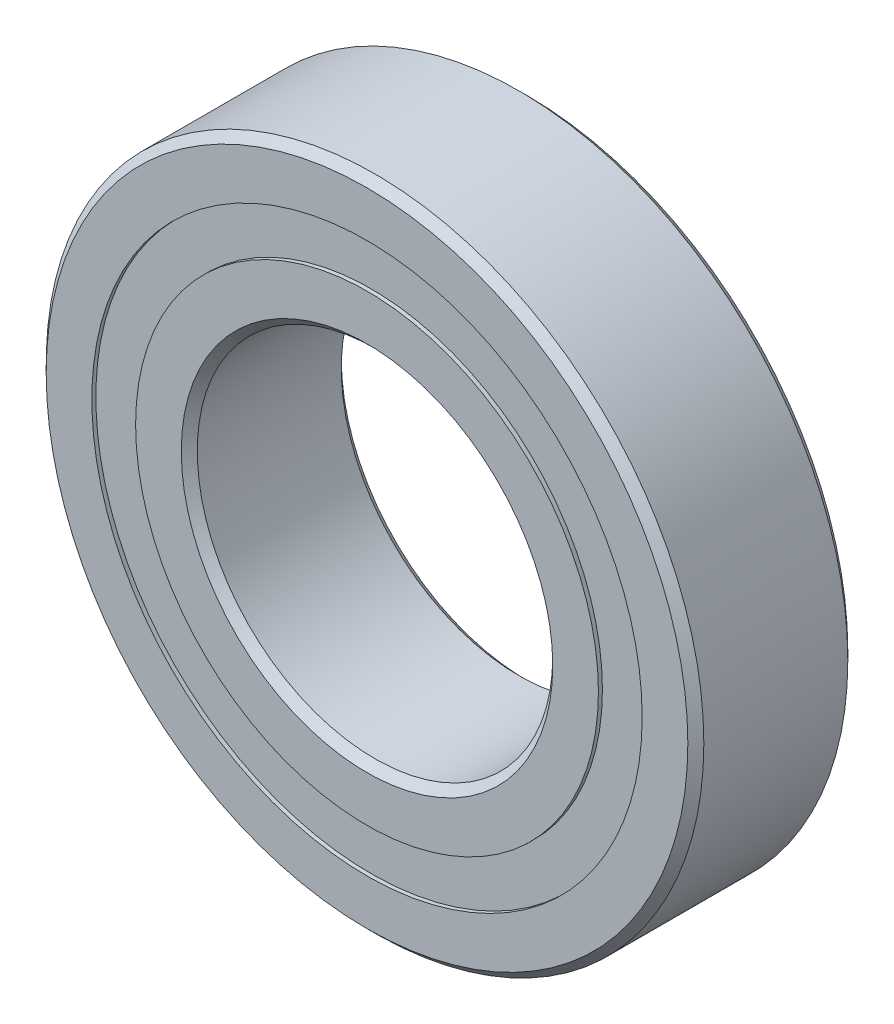
ISO-10303-21;
HEADER;
FILE_DESCRIPTION(('STEP AP214'),'2;1');
FILE_NAME('part.step','',(''),(''),'','','');
FILE_SCHEMA(('AUTOMOTIVE_DESIGN { 1 0 10303 214 1 1 1 1 }'));
ENDSEC;
DATA;
#1=APPLICATION_CONTEXT('core data for automotive mechanical design processes');
#2=APPLICATION_PROTOCOL_DEFINITION('international standard','automotive_design',2000,#1);
#3=PRODUCT_CONTEXT('',#1,'mechanical');
#4=PRODUCT('Part','Part','',(#3));
#5=PRODUCT_RELATED_PRODUCT_CATEGORY('part','',(#4));
#6=PRODUCT_DEFINITION_FORMATION('','',#4);
#7=PRODUCT_DEFINITION_CONTEXT('part definition',#1,'design');
#8=PRODUCT_DEFINITION('design','',#6,#7);
#9=PRODUCT_DEFINITION_SHAPE('','',#8);
#10=(LENGTH_UNIT() NAMED_UNIT(*) SI_UNIT(.MILLI.,.METRE.));
#11=(NAMED_UNIT(*) PLANE_ANGLE_UNIT() SI_UNIT($,.RADIAN.));
#12=(NAMED_UNIT(*) SI_UNIT($,.STERADIAN.) SOLID_ANGLE_UNIT());
#13=UNCERTAINTY_MEASURE_WITH_UNIT(LENGTH_MEASURE(1.E-05),#10,'distance_accuracy_value','');
#14=(GEOMETRIC_REPRESENTATION_CONTEXT(3) GLOBAL_UNCERTAINTY_ASSIGNED_CONTEXT((#13)) GLOBAL_UNIT_ASSIGNED_CONTEXT((#10,
#11,#12)) REPRESENTATION_CONTEXT('',''));
#15=CARTESIAN_POINT('',(0.,0.,0.));
#16=DIRECTION('',(0.,0.,1.));
#17=DIRECTION('',(1.,0.,0.));
#18=AXIS2_PLACEMENT_3D('',#15,#16,#17);
#19=CARTESIAN_POINT('',(0.,15.4807692307692,-4.27499999999997));
#20=DIRECTION('',(0.,0.,1.));
#21=DIRECTION('',(1.,0.,0.));
#22=AXIS2_PLACEMENT_3D('',#19,#20,#21);
#23=PLANE('',#22);
#24=CARTESIAN_POINT('',(0.,0.,-4.27500000000003));
#25=DIRECTION('',(0.,0.,1.));
#26=DIRECTION('',(1.,0.,0.));
#27=AXIS2_PLACEMENT_3D('',#24,#25,#26);
#28=CIRCLE('',#27,15.4807692307692);
#29=CARTESIAN_POINT('',(15.4807692307692,0.,-4.27500000000003));
#30=VERTEX_POINT('',#29);
#31=EDGE_CURVE('E66',#30,#30,#28,.T.);
#32=ORIENTED_EDGE('',*,*,#31,.F.);
#33=EDGE_LOOP('',(#32));
#34=FACE_BOUND('',#33,.T.);
#35=CARTESIAN_POINT('',(0.,0.,-4.27500000000003));
#36=DIRECTION('',(0.,0.,1.));
#37=DIRECTION('',(1.,0.,0.));
#38=AXIS2_PLACEMENT_3D('',#35,#36,#37);
#39=CIRCLE('',#38,13.0192307692308);
#40=CARTESIAN_POINT('',(13.0192307692308,0.,-4.27500000000003));
#41=VERTEX_POINT('',#40);
#42=EDGE_CURVE('E11',#41,#41,#39,.T.);
#43=ORIENTED_EDGE('',*,*,#42,.T.);
#44=EDGE_LOOP('',(#43));
#45=FACE_BOUND('',#44,.T.);
#46=ADVANCED_FACE('F52',(#34,#45),#23,.F.);
#47=CARTESIAN_POINT('',(0.,0.,4.5));
#48=DIRECTION('',(0.,0.,1.));
#49=DIRECTION('',(1.,0.,0.));
#50=AXIS2_PLACEMENT_3D('',#47,#48,#49);
#51=CYLINDRICAL_SURFACE('',#50,13.0192307692308);
#52=ORIENTED_EDGE('',*,*,#42,.F.);
#53=EDGE_LOOP('',(#52));
#54=FACE_BOUND('',#53,.T.);
#55=CARTESIAN_POINT('',(0.,0.,-2.34835961884211));
#56=DIRECTION('',(0.,0.,1.));
#57=DIRECTION('',(1.,0.,0.));
#58=AXIS2_PLACEMENT_3D('',#55,#56,#57);
#59=CIRCLE('',#58,13.0192307692308);
#60=CARTESIAN_POINT('',(13.0192307692308,0.,-2.34835961884211));
#61=VERTEX_POINT('',#60);
#62=EDGE_CURVE('E58',#61,#61,#59,.T.);
#63=ORIENTED_EDGE('',*,*,#62,.T.);
#64=EDGE_LOOP('',(#63));
#65=FACE_BOUND('',#64,.T.);
#66=ADVANCED_FACE('F75',(#54,#65),#51,.F.);
#67=CARTESIAN_POINT('',(0.,15.4807692307692,-2.34835961884211));
#68=DIRECTION('',(0.,0.,-1.));
#69=DIRECTION('',(-1.,0.,0.));
#70=AXIS2_PLACEMENT_3D('',#67,#68,#69);
#71=PLANE('',#70);
#72=ORIENTED_EDGE('',*,*,#62,.F.);
#73=EDGE_LOOP('',(#72));
#74=FACE_BOUND('',#73,.T.);
#75=CARTESIAN_POINT('',(0.,0.,-2.34835961884211));
#76=DIRECTION('',(0.,0.,1.));
#77=DIRECTION('',(1.,0.,0.));
#78=AXIS2_PLACEMENT_3D('',#75,#76,#77);
#79=CIRCLE('',#78,15.4807692307692);
#80=CARTESIAN_POINT('',(15.4807692307692,0.,-2.34835961884211));
#81=VERTEX_POINT('',#80);
#82=EDGE_CURVE('E62',#81,#81,#79,.T.);
#83=ORIENTED_EDGE('',*,*,#82,.T.);
#84=EDGE_LOOP('',(#83));
#85=FACE_BOUND('',#84,.T.);
#86=ADVANCED_FACE('F79',(#74,#85),#71,.F.);
#87=CARTESIAN_POINT('',(0.,0.,4.5));
#88=DIRECTION('',(0.,0.,1.));
#89=DIRECTION('',(1.,0.,0.));
#90=AXIS2_PLACEMENT_3D('',#87,#88,#89);
#91=CYLINDRICAL_SURFACE('',#90,15.4807692307692);
#92=ORIENTED_EDGE('',*,*,#82,.F.);
#93=EDGE_LOOP('',(#92));
#94=FACE_BOUND('',#93,.T.);
#95=ORIENTED_EDGE('',*,*,#31,.T.);
#96=EDGE_LOOP('',(#95));
#97=FACE_BOUND('',#96,.T.);
#98=ADVANCED_FACE('F72',(#94,#97),#91,.T.);
#99=CLOSED_SHELL('',(#46,#66,#86,#98));
#100=MANIFOLD_SOLID_BREP('B2',#99);
#101=CARTESIAN_POINT('',(0.,15.4807692307692,4.27500000000003));
#102=DIRECTION('',(0.,0.,-1.));
#103=DIRECTION('',(-1.,0.,0.));
#104=AXIS2_PLACEMENT_3D('',#101,#102,#103);
#105=PLANE('',#104);
#106=CARTESIAN_POINT('',(0.,0.,4.27500000000003));
#107=DIRECTION('',(0.,0.,1.));
#108=DIRECTION('',(1.,0.,0.));
#109=AXIS2_PLACEMENT_3D('',#106,#107,#108);
#110=CIRCLE('',#109,13.0192307692308);
#111=CARTESIAN_POINT('',(13.0192307692308,0.,4.27500000000003));
#112=VERTEX_POINT('',#111);
#113=EDGE_CURVE('E51',#112,#112,#110,.T.);
#114=ORIENTED_EDGE('',*,*,#113,.F.);
#115=EDGE_LOOP('',(#114));
#116=FACE_BOUND('',#115,.T.);
#117=CARTESIAN_POINT('',(0.,0.,4.27500000000003));
#118=DIRECTION('',(0.,0.,1.));
#119=DIRECTION('',(1.,0.,0.));
#120=AXIS2_PLACEMENT_3D('',#117,#118,#119);
#121=CIRCLE('',#120,15.4807692307692);
#122=CARTESIAN_POINT('',(15.4807692307692,0.,4.27500000000003));
#123=VERTEX_POINT('',#122);
#124=EDGE_CURVE('E142',#123,#123,#121,.T.);
#125=ORIENTED_EDGE('',*,*,#124,.T.);
#126=EDGE_LOOP('',(#125));
#127=FACE_BOUND('',#126,.T.);
#128=ADVANCED_FACE('F128',(#116,#127),#105,.F.);
#129=CARTESIAN_POINT('',(0.,0.,4.5));
#130=DIRECTION('',(0.,0.,1.));
#131=DIRECTION('',(1.,0.,0.));
#132=AXIS2_PLACEMENT_3D('',#129,#130,#131);
#133=CYLINDRICAL_SURFACE('',#132,13.0192307692308);
#134=CARTESIAN_POINT('',(0.,0.,2.34835961884211));
#135=DIRECTION('',(0.,0.,1.));
#136=DIRECTION('',(1.,0.,0.));
#137=AXIS2_PLACEMENT_3D('',#134,#135,#136);
#138=CIRCLE('',#137,13.0192307692308);
#139=CARTESIAN_POINT('',(13.0192307692308,0.,2.34835961884211));
#140=VERTEX_POINT('',#139);
#141=EDGE_CURVE('E134',#140,#140,#138,.T.);
#142=ORIENTED_EDGE('',*,*,#141,.F.);
#143=EDGE_LOOP('',(#142));
#144=FACE_BOUND('',#143,.T.);
#145=ORIENTED_EDGE('',*,*,#113,.T.);
#146=EDGE_LOOP('',(#145));
#147=FACE_BOUND('',#146,.T.);
#148=ADVANCED_FACE('F157',(#144,#147),#133,.F.);
#149=CARTESIAN_POINT('',(0.,15.4807692307692,2.34835961884211));
#150=DIRECTION('',(0.,0.,1.));
#151=DIRECTION('',(1.,0.,0.));
#152=AXIS2_PLACEMENT_3D('',#149,#150,#151);
#153=PLANE('',#152);
#154=CARTESIAN_POINT('',(0.,0.,2.34835961884211));
#155=DIRECTION('',(0.,0.,1.));
#156=DIRECTION('',(1.,0.,0.));
#157=AXIS2_PLACEMENT_3D('',#154,#155,#156);
#158=CIRCLE('',#157,15.4807692307692);
#159=CARTESIAN_POINT('',(15.4807692307692,0.,2.34835961884211));
#160=VERTEX_POINT('',#159);
#161=EDGE_CURVE('E138',#160,#160,#158,.T.);
#162=ORIENTED_EDGE('',*,*,#161,.F.);
#163=EDGE_LOOP('',(#162));
#164=FACE_BOUND('',#163,.T.);
#165=ORIENTED_EDGE('',*,*,#141,.T.);
#166=EDGE_LOOP('',(#165));
#167=FACE_BOUND('',#166,.T.);
#168=ADVANCED_FACE('F152',(#164,#167),#153,.F.);
#169=CARTESIAN_POINT('',(0.,0.,4.5));
#170=DIRECTION('',(0.,0.,1.));
#171=DIRECTION('',(1.,0.,0.));
#172=AXIS2_PLACEMENT_3D('',#169,#170,#171);
#173=CYLINDRICAL_SURFACE('',#172,15.4807692307692);
#174=ORIENTED_EDGE('',*,*,#124,.F.);
#175=EDGE_LOOP('',(#174));
#176=FACE_BOUND('',#175,.T.);
#177=ORIENTED_EDGE('',*,*,#161,.T.);
#178=EDGE_LOOP('',(#177));
#179=FACE_BOUND('',#178,.T.);
#180=ADVANCED_FACE('F149',(#176,#179),#173,.T.);
#181=CLOSED_SHELL('',(#128,#148,#168,#180));
#182=MANIFOLD_SOLID_BREP('B6',#181);
#183=CARTESIAN_POINT('',(-7.12499999999984,12.3408620039283,0.));
#184=DIRECTION('',(0.,0.,1.));
#185=DIRECTION('',(-0.499999999999989,0.866025403784445,0.));
#186=AXIS2_PLACEMENT_3D('',#183,#184,#185);
#187=SPHERICAL_SURFACE('',#186,2.34835961884211);
#188=CARTESIAN_POINT('',(-7.12499999999984,12.3408620039283,2.34835961884211));
#189=VERTEX_POINT('',#188);
#190=VERTEX_LOOP('',#189);
#191=FACE_BOUND('',#190,.T.);
#192=ADVANCED_FACE('F204',(#191),#187,.T.);
#193=CLOSED_SHELL('',(#192));
#194=MANIFOLD_SOLID_BREP('B46',#193);
#195=CARTESIAN_POINT('',(-12.3408620039282,7.12500000000014,0.));
#196=DIRECTION('',(0.,0.,1.));
#197=DIRECTION('',(-0.866025403784433,0.50000000000001,0.));
#198=AXIS2_PLACEMENT_3D('',#195,#196,#197);
#199=SPHERICAL_SURFACE('',#198,2.34835961884211);
#200=CARTESIAN_POINT('',(-12.3408620039282,7.12500000000014,2.34835961884211));
#201=VERTEX_POINT('',#200);
#202=VERTEX_LOOP('',#201);
#203=FACE_BOUND('',#202,.T.);
#204=ADVANCED_FACE('F227',(#203),#199,.T.);
#205=CLOSED_SHELL('',(#204));
#206=MANIFOLD_SOLID_BREP('B124',#205);
#207=CARTESIAN_POINT('',(-14.25,1.49260827235544E-13,0.));
#208=DIRECTION('',(0.,0.,1.));
#209=DIRECTION('',(-1.,0.,0.));
#210=AXIS2_PLACEMENT_3D('',#207,#208,#209);
#211=SPHERICAL_SURFACE('',#210,2.34835961884211);
#212=CARTESIAN_POINT('',(-14.25,1.49260827235544E-13,2.34835961884211));
#213=VERTEX_POINT('',#212);
#214=VERTEX_LOOP('',#213);
#215=FACE_BOUND('',#214,.T.);
#216=ADVANCED_FACE('F250',(#215),#211,.T.);
#217=CLOSED_SHELL('',(#216));
#218=MANIFOLD_SOLID_BREP('B200',#217);
#219=CARTESIAN_POINT('',(-12.3408620039283,-7.12499999999988,0.));
#220=DIRECTION('',(0.,0.,1.));
#221=DIRECTION('',(-0.866025403784443,-0.499999999999992,0.));
#222=AXIS2_PLACEMENT_3D('',#219,#220,#221);
#223=SPHERICAL_SURFACE('',#222,2.34835961884211);
#224=CARTESIAN_POINT('',(-12.3408620039283,-7.12499999999988,2.34835961884211));
#225=VERTEX_POINT('',#224);
#226=VERTEX_LOOP('',#225);
#227=FACE_BOUND('',#226,.T.);
#228=ADVANCED_FACE('F273',(#227),#223,.T.);
#229=CLOSED_SHELL('',(#228));
#230=MANIFOLD_SOLID_BREP('B223',#229);
#231=CARTESIAN_POINT('',(-7.1250000000001,-12.3408620039282,0.));
#232=DIRECTION('',(0.,0.,1.));
#233=DIRECTION('',(-0.500000000000007,-0.866025403784435,0.));
#234=AXIS2_PLACEMENT_3D('',#231,#232,#233);
#235=SPHERICAL_SURFACE('',#234,2.34835961884211);
#236=CARTESIAN_POINT('',(-7.1250000000001,-12.3408620039282,2.34835961884211));
#237=VERTEX_POINT('',#236);
#238=VERTEX_LOOP('',#237);
#239=FACE_BOUND('',#238,.T.);
#240=ADVANCED_FACE('F296',(#239),#235,.T.);
#241=CLOSED_SHELL('',(#240));
#242=MANIFOLD_SOLID_BREP('B246',#241);
#243=CARTESIAN_POINT('',(0.,-14.25,0.));
#244=DIRECTION('',(0.,0.,1.));
#245=DIRECTION('',(0.,-1.,0.));
#246=AXIS2_PLACEMENT_3D('',#243,#244,#245);
#247=SPHERICAL_SURFACE('',#246,2.34835961884211);
#248=CARTESIAN_POINT('',(0.,-14.25,2.34835961884211));
#249=VERTEX_POINT('',#248);
#250=VERTEX_LOOP('',#249);
#251=FACE_BOUND('',#250,.T.);
#252=ADVANCED_FACE('F319',(#251),#247,.T.);
#253=CLOSED_SHELL('',(#252));
#254=MANIFOLD_SOLID_BREP('B269',#253);
#255=CARTESIAN_POINT('',(7.12499999999993,-12.3408620039283,0.));
#256=DIRECTION('',(0.,0.,1.));
#257=DIRECTION('',(0.499999999999995,-0.866025403784442,0.));
#258=AXIS2_PLACEMENT_3D('',#255,#256,#257);
#259=SPHERICAL_SURFACE('',#258,2.34835961884211);
#260=CARTESIAN_POINT('',(7.12499999999993,-12.3408620039283,2.34835961884211));
#261=VERTEX_POINT('',#260);
#262=VERTEX_LOOP('',#261);
#263=FACE_BOUND('',#262,.T.);
#264=ADVANCED_FACE('F342',(#263),#259,.T.);
#265=CLOSED_SHELL('',(#264));
#266=MANIFOLD_SOLID_BREP('B292',#265);
#267=CARTESIAN_POINT('',(12.3408620039282,-7.12500000000006,0.));
#268=DIRECTION('',(0.,0.,1.));
#269=DIRECTION('',(0.866025403784436,-0.500000000000004,0.));
#270=AXIS2_PLACEMENT_3D('',#267,#268,#269);
#271=SPHERICAL_SURFACE('',#270,2.34835961884211);
#272=CARTESIAN_POINT('',(12.3408620039282,-7.12500000000006,2.34835961884211));
#273=VERTEX_POINT('',#272);
#274=VERTEX_LOOP('',#273);
#275=FACE_BOUND('',#274,.T.);
#276=ADVANCED_FACE('F365',(#275),#271,.T.);
#277=CLOSED_SHELL('',(#276));
#278=MANIFOLD_SOLID_BREP('B315',#277);
#279=CARTESIAN_POINT('',(14.25,0.,0.));
#280=DIRECTION('',(0.,0.,1.));
#281=DIRECTION('',(1.,0.,0.));
#282=AXIS2_PLACEMENT_3D('',#279,#280,#281);
#283=SPHERICAL_SURFACE('',#282,2.34835961884211);
#284=CARTESIAN_POINT('',(14.25,0.,2.34835961884211));
#285=VERTEX_POINT('',#284);
#286=VERTEX_LOOP('',#285);
#287=FACE_BOUND('',#286,.T.);
#288=ADVANCED_FACE('F388',(#287),#283,.T.);
#289=CLOSED_SHELL('',(#288));
#290=MANIFOLD_SOLID_BREP('B338',#289);
#291=CARTESIAN_POINT('',(12.3408620039283,7.12499999999997,0.));
#292=DIRECTION('',(0.,0.,1.));
#293=DIRECTION('',(0.86602540378444,0.499999999999998,0.));
#294=AXIS2_PLACEMENT_3D('',#291,#292,#293);
#295=SPHERICAL_SURFACE('',#294,2.34835961884211);
#296=CARTESIAN_POINT('',(12.3408620039283,7.12499999999997,2.34835961884211));
#297=VERTEX_POINT('',#296);
#298=VERTEX_LOOP('',#297);
#299=FACE_BOUND('',#298,.T.);
#300=ADVANCED_FACE('F411',(#299),#295,.T.);
#301=CLOSED_SHELL('',(#300));
#302=MANIFOLD_SOLID_BREP('B361',#301);
#303=CARTESIAN_POINT('',(7.12500000000001,12.3408620039282,0.));
#304=DIRECTION('',(0.,0.,1.));
#305=DIRECTION('',(0.500000000000001,0.866025403784438,0.));
#306=AXIS2_PLACEMENT_3D('',#303,#304,#305);
#307=SPHERICAL_SURFACE('',#306,2.34835961884211);
#308=CARTESIAN_POINT('',(7.12500000000001,12.3408620039282,2.34835961884211));
#309=VERTEX_POINT('',#308);
#310=VERTEX_LOOP('',#309);
#311=FACE_BOUND('',#310,.T.);
#312=ADVANCED_FACE('F434',(#311),#307,.T.);
#313=CLOSED_SHELL('',(#312));
#314=MANIFOLD_SOLID_BREP('B384',#313);
#315=CARTESIAN_POINT('',(0.,14.25,0.));
#316=DIRECTION('',(0.,0.,1.));
#317=DIRECTION('',(0.,1.,0.));
#318=AXIS2_PLACEMENT_3D('',#315,#316,#317);
#319=SPHERICAL_SURFACE('',#318,2.34835961884211);
#320=CARTESIAN_POINT('',(0.,14.25,2.34835961884211));
#321=VERTEX_POINT('',#320);
#322=VERTEX_LOOP('',#321);
#323=FACE_BOUND('',#322,.T.);
#324=ADVANCED_FACE('F459',(#323),#319,.T.);
#325=CLOSED_SHELL('',(#324));
#326=MANIFOLD_SOLID_BREP('B407',#325);
#327=CARTESIAN_POINT('',(0.,13.0192307692308,4.5));
#328=DIRECTION('',(0.,0.,-1.));
#329=DIRECTION('',(-1.,0.,0.));
#330=AXIS2_PLACEMENT_3D('',#327,#328,#329);
#331=PLANE('',#330);
#332=CARTESIAN_POINT('',(0.,0.,4.5));
#333=DIRECTION('',(0.,0.,1.));
#334=DIRECTION('',(1.,0.,0.));
#335=AXIS2_PLACEMENT_3D('',#332,#333,#334);
#336=CIRCLE('',#335,10.45);
#337=CARTESIAN_POINT('',(10.45,0.,4.5));
#338=VERTEX_POINT('',#337);
#339=EDGE_CURVE('E505',#338,#338,#336,.T.);
#340=ORIENTED_EDGE('',*,*,#339,.F.);
#341=EDGE_LOOP('',(#340));
#342=FACE_BOUND('',#341,.T.);
#343=CARTESIAN_POINT('',(0.,0.,4.5));
#344=DIRECTION('',(0.,0.,1.));
#345=DIRECTION('',(1.,0.,0.));
#346=AXIS2_PLACEMENT_3D('',#343,#344,#345);
#347=CIRCLE('',#346,13.0192307692308);
#348=CARTESIAN_POINT('',(13.0192307692308,0.,4.5));
#349=VERTEX_POINT('',#348);
#350=EDGE_CURVE('E458',#349,#349,#347,.T.);
#351=ORIENTED_EDGE('',*,*,#350,.T.);
#352=EDGE_LOOP('',(#351));
#353=FACE_BOUND('',#352,.T.);
#354=ADVANCED_FACE('F477',(#342,#353),#331,.F.);
#355=CARTESIAN_POINT('',(0.,0.,4.5));
#356=DIRECTION('',(0.,0.,1.));
#357=DIRECTION('',(1.,0.,0.));
#358=AXIS2_PLACEMENT_3D('',#355,#356,#357);
#359=CYLINDRICAL_SURFACE('',#358,13.0192307692308);
#360=ORIENTED_EDGE('',*,*,#350,.F.);
#361=EDGE_LOOP('',(#360));
#362=FACE_BOUND('',#361,.T.);
#363=CARTESIAN_POINT('',(0.,0.,2.));
#364=DIRECTION('',(0.,0.,1.));
#365=DIRECTION('',(1.,0.,0.));
#366=AXIS2_PLACEMENT_3D('',#363,#364,#365);
#367=CIRCLE('',#366,13.0192307692308);
#368=CARTESIAN_POINT('',(13.0192307692308,0.,2.));
#369=VERTEX_POINT('',#368);
#370=EDGE_CURVE('E483',#369,#369,#367,.T.);
#371=ORIENTED_EDGE('',*,*,#370,.T.);
#372=EDGE_LOOP('',(#371));
#373=FACE_BOUND('',#372,.T.);
#374=ADVANCED_FACE('F512',(#362,#373),#359,.T.);
#375=CARTESIAN_POINT('',(0.,0.,0.));
#376=DIRECTION('',(0.,0.,1.));
#377=DIRECTION('',(1.,0.,0.));
#378=AXIS2_PLACEMENT_3D('',#375,#376,#377);
#379=TOROIDAL_SURFACE('',#378,14.25,2.34835961884211);
#380=ORIENTED_EDGE('',*,*,#370,.F.);
#381=EDGE_LOOP('',(#380));
#382=FACE_BOUND('',#381,.T.);
#383=CARTESIAN_POINT('',(0.,0.,-2.));
#384=DIRECTION('',(0.,0.,1.));
#385=DIRECTION('',(1.,0.,0.));
#386=AXIS2_PLACEMENT_3D('',#383,#384,#385);
#387=CIRCLE('',#386,13.0192307692308);
#388=CARTESIAN_POINT('',(13.0192307692308,0.,-2.));
#389=VERTEX_POINT('',#388);
#390=EDGE_CURVE('E487',#389,#389,#387,.T.);
#391=ORIENTED_EDGE('',*,*,#390,.T.);
#392=EDGE_LOOP('',(#391));
#393=FACE_BOUND('',#392,.T.);
#394=ADVANCED_FACE('F516',(#382,#393),#379,.F.);
#395=CARTESIAN_POINT('',(0.,0.,4.5));
#396=DIRECTION('',(0.,0.,1.));
#397=DIRECTION('',(1.,0.,0.));
#398=AXIS2_PLACEMENT_3D('',#395,#396,#397);
#399=CYLINDRICAL_SURFACE('',#398,13.0192307692308);
#400=ORIENTED_EDGE('',*,*,#390,.F.);
#401=EDGE_LOOP('',(#400));
#402=FACE_BOUND('',#401,.T.);
#403=CARTESIAN_POINT('',(0.,0.,-4.5));
#404=DIRECTION('',(0.,0.,1.));
#405=DIRECTION('',(1.,0.,0.));
#406=AXIS2_PLACEMENT_3D('',#403,#404,#405);
#407=CIRCLE('',#406,13.0192307692308);
#408=CARTESIAN_POINT('',(13.0192307692308,0.,-4.5));
#409=VERTEX_POINT('',#408);
#410=EDGE_CURVE('E491',#409,#409,#407,.T.);
#411=ORIENTED_EDGE('',*,*,#410,.T.);
#412=EDGE_LOOP('',(#411));
#413=FACE_BOUND('',#412,.T.);
#414=ADVANCED_FACE('F521',(#402,#413),#399,.T.);
#415=CARTESIAN_POINT('',(0.,10.45,-4.5));
#416=DIRECTION('',(0.,0.,1.));
#417=DIRECTION('',(1.,0.,0.));
#418=AXIS2_PLACEMENT_3D('',#415,#416,#417);
#419=PLANE('',#418);
#420=ORIENTED_EDGE('',*,*,#410,.F.);
#421=EDGE_LOOP('',(#420));
#422=FACE_BOUND('',#421,.T.);
#423=CARTESIAN_POINT('',(0.,0.,-4.5));
#424=DIRECTION('',(0.,0.,1.));
#425=DIRECTION('',(1.,0.,0.));
#426=AXIS2_PLACEMENT_3D('',#423,#424,#425);
#427=CIRCLE('',#426,10.45);
#428=CARTESIAN_POINT('',(10.45,0.,-4.5));
#429=VERTEX_POINT('',#428);
#430=EDGE_CURVE('E496',#429,#429,#427,.T.);
#431=ORIENTED_EDGE('',*,*,#430,.T.);
#432=EDGE_LOOP('',(#431));
#433=FACE_BOUND('',#432,.T.);
#434=ADVANCED_FACE('F527',(#422,#433),#419,.F.);
#435=CARTESIAN_POINT('',(0.,0.,-4.05));
#436=DIRECTION('',(0.,0.,-1.));
#437=DIRECTION('',(-1.,0.,0.));
#438=AXIS2_PLACEMENT_3D('',#435,#436,#437);
#439=CONICAL_SURFACE('',#438,10.,0.785398163397448);
#440=ORIENTED_EDGE('',*,*,#430,.F.);
#441=EDGE_LOOP('',(#440));
#442=FACE_BOUND('',#441,.T.);
#443=CARTESIAN_POINT('',(0.,0.,-4.05));
#444=DIRECTION('',(0.,0.,1.));
#445=DIRECTION('',(1.,0.,0.));
#446=AXIS2_PLACEMENT_3D('',#443,#444,#445);
#447=CIRCLE('',#446,10.);
#448=CARTESIAN_POINT('',(10.,0.,-4.05));
#449=VERTEX_POINT('',#448);
#450=EDGE_CURVE('E499',#449,#449,#447,.T.);
#451=ORIENTED_EDGE('',*,*,#450,.T.);
#452=EDGE_LOOP('',(#451));
#453=FACE_BOUND('',#452,.T.);
#454=ADVANCED_FACE('F531',(#442,#453),#439,.F.);
#455=CARTESIAN_POINT('',(0.,0.,4.5));
#456=DIRECTION('',(0.,0.,1.));
#457=DIRECTION('',(1.,0.,0.));
#458=AXIS2_PLACEMENT_3D('',#455,#456,#457);
#459=CYLINDRICAL_SURFACE('',#458,10.);
#460=ORIENTED_EDGE('',*,*,#450,.F.);
#461=EDGE_LOOP('',(#460));
#462=FACE_BOUND('',#461,.T.);
#463=CARTESIAN_POINT('',(0.,0.,4.05));
#464=DIRECTION('',(0.,0.,1.));
#465=DIRECTION('',(1.,0.,0.));
#466=AXIS2_PLACEMENT_3D('',#463,#464,#465);
#467=CIRCLE('',#466,10.);
#468=CARTESIAN_POINT('',(10.,0.,4.05));
#469=VERTEX_POINT('',#468);
#470=EDGE_CURVE('E502',#469,#469,#467,.T.);
#471=ORIENTED_EDGE('',*,*,#470,.T.);
#472=EDGE_LOOP('',(#471));
#473=FACE_BOUND('',#472,.T.);
#474=ADVANCED_FACE('F535',(#462,#473),#459,.F.);
#475=CARTESIAN_POINT('',(0.,0.,4.5));
#476=DIRECTION('',(0.,0.,1.));
#477=DIRECTION('',(1.,0.,0.));
#478=AXIS2_PLACEMENT_3D('',#475,#476,#477);
#479=CONICAL_SURFACE('',#478,10.45,0.785398163397448);
#480=ORIENTED_EDGE('',*,*,#470,.F.);
#481=EDGE_LOOP('',(#480));
#482=FACE_BOUND('',#481,.T.);
#483=ORIENTED_EDGE('',*,*,#339,.T.);
#484=EDGE_LOOP('',(#483));
#485=FACE_BOUND('',#484,.T.);
#486=ADVANCED_FACE('F509',(#482,#485),#479,.F.);
#487=CLOSED_SHELL('',(#354,#374,#394,#414,#434,#454,#474,#486));
#488=MANIFOLD_SOLID_BREP('B430',#487);
#489=CARTESIAN_POINT('',(0.,0.,4.05));
#490=DIRECTION('',(0.,0.,-1.));
#491=DIRECTION('',(-1.,0.,0.));
#492=AXIS2_PLACEMENT_3D('',#489,#490,#491);
#493=CONICAL_SURFACE('',#492,18.5,0.785398163397447);
#494=CARTESIAN_POINT('',(0.,0.,4.5));
#495=DIRECTION('',(0.,0.,1.));
#496=DIRECTION('',(1.,0.,0.));
#497=AXIS2_PLACEMENT_3D('',#494,#495,#496);
#498=CIRCLE('',#497,18.05);
#499=CARTESIAN_POINT('',(18.05,0.,4.5));
#500=VERTEX_POINT('',#499);
#501=EDGE_CURVE('E611',#500,#500,#498,.T.);
#502=ORIENTED_EDGE('',*,*,#501,.F.);
#503=EDGE_LOOP('',(#502));
#504=FACE_BOUND('',#503,.T.);
#505=CARTESIAN_POINT('',(0.,0.,4.05));
#506=DIRECTION('',(0.,0.,1.));
#507=DIRECTION('',(1.,0.,0.));
#508=AXIS2_PLACEMENT_3D('',#505,#506,#507);
#509=CIRCLE('',#508,18.5);
#510=CARTESIAN_POINT('',(18.5,0.,4.05));
#511=VERTEX_POINT('',#510);
#512=EDGE_CURVE('E476',#511,#511,#509,.T.);
#513=ORIENTED_EDGE('',*,*,#512,.T.);
#514=EDGE_LOOP('',(#513));
#515=FACE_BOUND('',#514,.T.);
#516=ADVANCED_FACE('F583',(#504,#515),#493,.T.);
#517=CARTESIAN_POINT('',(0.,0.,4.5));
#518=DIRECTION('',(0.,0.,1.));
#519=DIRECTION('',(1.,0.,0.));
#520=AXIS2_PLACEMENT_3D('',#517,#518,#519);
#521=CYLINDRICAL_SURFACE('',#520,18.5);
#522=ORIENTED_EDGE('',*,*,#512,.F.);
#523=EDGE_LOOP('',(#522));
#524=FACE_BOUND('',#523,.T.);
#525=CARTESIAN_POINT('',(0.,0.,-4.05));
#526=DIRECTION('',(0.,0.,1.));
#527=DIRECTION('',(1.,0.,0.));
#528=AXIS2_PLACEMENT_3D('',#525,#526,#527);
#529=CIRCLE('',#528,18.5);
#530=CARTESIAN_POINT('',(18.5,0.,-4.05));
#531=VERTEX_POINT('',#530);
#532=EDGE_CURVE('E589',#531,#531,#529,.T.);
#533=ORIENTED_EDGE('',*,*,#532,.T.);
#534=EDGE_LOOP('',(#533));
#535=FACE_BOUND('',#534,.T.);
#536=ADVANCED_FACE('F618',(#524,#535),#521,.T.);
#537=CARTESIAN_POINT('',(0.,0.,-4.5));
#538=DIRECTION('',(0.,0.,1.));
#539=DIRECTION('',(1.,0.,0.));
#540=AXIS2_PLACEMENT_3D('',#537,#538,#539);
#541=CONICAL_SURFACE('',#540,18.05,0.785398163397448);
#542=ORIENTED_EDGE('',*,*,#532,.F.);
#543=EDGE_LOOP('',(#542));
#544=FACE_BOUND('',#543,.T.);
#545=CARTESIAN_POINT('',(0.,0.,-4.5));
#546=DIRECTION('',(0.,0.,1.));
#547=DIRECTION('',(1.,0.,0.));
#548=AXIS2_PLACEMENT_3D('',#545,#546,#547);
#549=CIRCLE('',#548,18.05);
#550=CARTESIAN_POINT('',(18.05,0.,-4.5));
#551=VERTEX_POINT('',#550);
#552=EDGE_CURVE('E593',#551,#551,#549,.T.);
#553=ORIENTED_EDGE('',*,*,#552,.T.);
#554=EDGE_LOOP('',(#553));
#555=FACE_BOUND('',#554,.T.);
#556=ADVANCED_FACE('F622',(#544,#555),#541,.T.);
#557=CARTESIAN_POINT('',(0.,18.05,-4.5));
#558=DIRECTION('',(0.,0.,1.));
#559=DIRECTION('',(1.,0.,0.));
#560=AXIS2_PLACEMENT_3D('',#557,#558,#559);
#561=PLANE('',#560);
#562=ORIENTED_EDGE('',*,*,#552,.F.);
#563=EDGE_LOOP('',(#562));
#564=FACE_BOUND('',#563,.T.);
#565=CARTESIAN_POINT('',(0.,0.,-4.5));
#566=DIRECTION('',(0.,0.,1.));
#567=DIRECTION('',(1.,0.,0.));
#568=AXIS2_PLACEMENT_3D('',#565,#566,#567);
#569=CIRCLE('',#568,15.4807692307692);
#570=CARTESIAN_POINT('',(15.4807692307692,0.,-4.5));
#571=VERTEX_POINT('',#570);
#572=EDGE_CURVE('E597',#571,#571,#569,.T.);
#573=ORIENTED_EDGE('',*,*,#572,.T.);
#574=EDGE_LOOP('',(#573));
#575=FACE_BOUND('',#574,.T.);
#576=ADVANCED_FACE('F627',(#564,#575),#561,.F.);
#577=CARTESIAN_POINT('',(0.,0.,4.5));
#578=DIRECTION('',(0.,0.,1.));
#579=DIRECTION('',(1.,0.,0.));
#580=AXIS2_PLACEMENT_3D('',#577,#578,#579);
#581=CYLINDRICAL_SURFACE('',#580,15.4807692307692);
#582=ORIENTED_EDGE('',*,*,#572,.F.);
#583=EDGE_LOOP('',(#582));
#584=FACE_BOUND('',#583,.T.);
#585=CARTESIAN_POINT('',(0.,0.,-2.));
#586=DIRECTION('',(0.,0.,1.));
#587=DIRECTION('',(1.,0.,0.));
#588=AXIS2_PLACEMENT_3D('',#585,#586,#587);
#589=CIRCLE('',#588,15.4807692307692);
#590=CARTESIAN_POINT('',(15.4807692307692,0.,-2.));
#591=VERTEX_POINT('',#590);
#592=EDGE_CURVE('E602',#591,#591,#589,.T.);
#593=ORIENTED_EDGE('',*,*,#592,.T.);
#594=EDGE_LOOP('',(#593));
#595=FACE_BOUND('',#594,.T.);
#596=ADVANCED_FACE('F633',(#584,#595),#581,.F.);
#597=CARTESIAN_POINT('',(0.,0.,0.));
#598=DIRECTION('',(0.,0.,1.));
#599=DIRECTION('',(1.,0.,0.));
#600=AXIS2_PLACEMENT_3D('',#597,#598,#599);
#601=TOROIDAL_SURFACE('',#600,14.25,2.34835961884211);
#602=ORIENTED_EDGE('',*,*,#592,.F.);
#603=EDGE_LOOP('',(#602));
#604=FACE_BOUND('',#603,.T.);
#605=CARTESIAN_POINT('',(0.,0.,2.));
#606=DIRECTION('',(0.,0.,1.));
#607=DIRECTION('',(1.,0.,0.));
#608=AXIS2_PLACEMENT_3D('',#605,#606,#607);
#609=CIRCLE('',#608,15.4807692307692);
#610=CARTESIAN_POINT('',(15.4807692307692,0.,2.));
#611=VERTEX_POINT('',#610);
#612=EDGE_CURVE('E605',#611,#611,#609,.T.);
#613=ORIENTED_EDGE('',*,*,#612,.T.);
#614=EDGE_LOOP('',(#613));
#615=FACE_BOUND('',#614,.T.);
#616=ADVANCED_FACE('F637',(#604,#615),#601,.F.);
#617=CARTESIAN_POINT('',(0.,0.,4.5));
#618=DIRECTION('',(0.,0.,1.));
#619=DIRECTION('',(1.,0.,0.));
#620=AXIS2_PLACEMENT_3D('',#617,#618,#619);
#621=CYLINDRICAL_SURFACE('',#620,15.4807692307692);
#622=ORIENTED_EDGE('',*,*,#612,.F.);
#623=EDGE_LOOP('',(#622));
#624=FACE_BOUND('',#623,.T.);
#625=CARTESIAN_POINT('',(0.,0.,4.5));
#626=DIRECTION('',(0.,0.,1.));
#627=DIRECTION('',(1.,0.,0.));
#628=AXIS2_PLACEMENT_3D('',#625,#626,#627);
#629=CIRCLE('',#628,15.4807692307692);
#630=CARTESIAN_POINT('',(15.4807692307692,0.,4.5));
#631=VERTEX_POINT('',#630);
#632=EDGE_CURVE('E608',#631,#631,#629,.T.);
#633=ORIENTED_EDGE('',*,*,#632,.T.);
#634=EDGE_LOOP('',(#633));
#635=FACE_BOUND('',#634,.T.);
#636=ADVANCED_FACE('F641',(#624,#635),#621,.F.);
#637=CARTESIAN_POINT('',(0.,18.05,4.5));
#638=DIRECTION('',(0.,0.,-1.));
#639=DIRECTION('',(-1.,0.,0.));
#640=AXIS2_PLACEMENT_3D('',#637,#638,#639);
#641=PLANE('',#640);
#642=ORIENTED_EDGE('',*,*,#632,.F.);
#643=EDGE_LOOP('',(#642));
#644=FACE_BOUND('',#643,.T.);
#645=ORIENTED_EDGE('',*,*,#501,.T.);
#646=EDGE_LOOP('',(#645));
#647=FACE_BOUND('',#646,.T.);
#648=ADVANCED_FACE('F615',(#644,#647),#641,.F.);
#649=CLOSED_SHELL('',(#516,#536,#556,#576,#596,#616,#636,#648));
#650=MANIFOLD_SOLID_BREP('B453',#649);
#651=ADVANCED_BREP_SHAPE_REPRESENTATION('',(#18,#100,#182,#194,#206,#218,#230,#242,#254,#266,
#278,#290,#302,#314,#326,#488,#650),#14);
#652=SHAPE_DEFINITION_REPRESENTATION(#9,#651);
ENDSEC;
END-ISO-10303-21;
